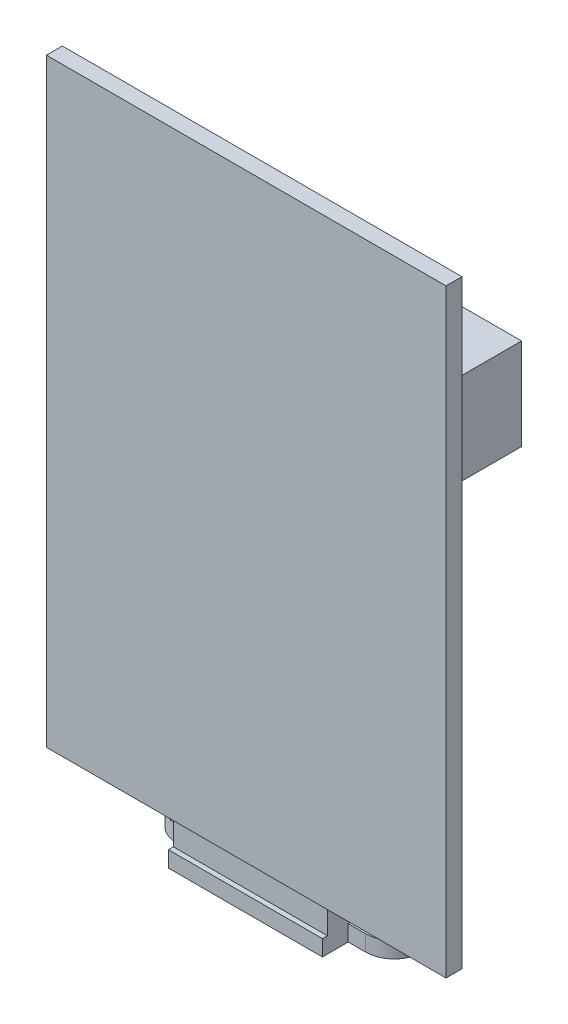
ISO-10303-21;
HEADER;
FILE_DESCRIPTION(('STEP AP214'),'2;1');
FILE_NAME('part.step','',(''),(''),'','','');
FILE_SCHEMA(('AUTOMOTIVE_DESIGN { 1 0 10303 214 1 1 1 1 }'));
ENDSEC;
DATA;
#1=APPLICATION_CONTEXT('core data for automotive mechanical design processes');
#2=APPLICATION_PROTOCOL_DEFINITION('international standard','automotive_design',2000,#1);
#3=PRODUCT_CONTEXT('',#1,'mechanical');
#4=PRODUCT('Part','Part','',(#3));
#5=PRODUCT_RELATED_PRODUCT_CATEGORY('part','',(#4));
#6=PRODUCT_DEFINITION_FORMATION('','',#4);
#7=PRODUCT_DEFINITION_CONTEXT('part definition',#1,'design');
#8=PRODUCT_DEFINITION('design','',#6,#7);
#9=PRODUCT_DEFINITION_SHAPE('','',#8);
#10=(LENGTH_UNIT() NAMED_UNIT(*) SI_UNIT(.MILLI.,.METRE.));
#11=(NAMED_UNIT(*) PLANE_ANGLE_UNIT() SI_UNIT($,.RADIAN.));
#12=(NAMED_UNIT(*) SI_UNIT($,.STERADIAN.) SOLID_ANGLE_UNIT());
#13=UNCERTAINTY_MEASURE_WITH_UNIT(LENGTH_MEASURE(1.E-05),#10,'distance_accuracy_value','');
#14=(GEOMETRIC_REPRESENTATION_CONTEXT(3) GLOBAL_UNCERTAINTY_ASSIGNED_CONTEXT((#13)) GLOBAL_UNIT_ASSIGNED_CONTEXT((#10,
#11,#12)) REPRESENTATION_CONTEXT('',''));
#15=CARTESIAN_POINT('',(0.,0.,0.));
#16=DIRECTION('',(0.,0.,1.));
#17=DIRECTION('',(1.,0.,0.));
#18=AXIS2_PLACEMENT_3D('',#15,#16,#17);
#19=CARTESIAN_POINT('',(-12.35,64.6,9.31228147882347));
#20=DIRECTION('',(0.,0.,1.));
#21=DIRECTION('',(1.,0.,0.));
#22=AXIS2_PLACEMENT_3D('',#19,#20,#21);
#23=PLANE('',#22);
#24=DIRECTION('',(-1.,0.,0.));
#25=VECTOR('',#24,1.);
#26=CARTESIAN_POINT('',(-12.35,4.3,9.31228147882347));
#27=LINE('',#26,#25);
#28=CARTESIAN_POINT('',(27.85,4.3,9.31228147882347));
#29=VERTEX_POINT('',#28);
#30=CARTESIAN_POINT('',(15.5,4.3,9.31228147882347));
#31=VERTEX_POINT('',#30);
#32=EDGE_CURVE('E48',#29,#31,#27,.T.);
#33=ORIENTED_EDGE('',*,*,#32,.T.);
#34=CARTESIAN_POINT('',(0.,4.3,9.31228147882347));
#35=VERTEX_POINT('',#34);
#36=EDGE_CURVE('E11',#31,#35,#27,.T.);
#37=ORIENTED_EDGE('',*,*,#36,.T.);
#38=CARTESIAN_POINT('',(-12.35,4.3,9.31228147882347));
#39=VERTEX_POINT('',#38);
#40=EDGE_CURVE('E49',#35,#39,#27,.T.);
#41=ORIENTED_EDGE('',*,*,#40,.T.);
#42=DIRECTION('',(0.,-1.,0.));
#43=VECTOR('',#42,1.);
#44=CARTESIAN_POINT('',(-12.35,64.6,9.31228147882347));
#45=LINE('',#44,#43);
#46=CARTESIAN_POINT('',(-12.35,64.6,9.31228147882347));
#47=VERTEX_POINT('',#46);
#48=EDGE_CURVE('E257',#47,#39,#45,.T.);
#49=ORIENTED_EDGE('',*,*,#48,.F.);
#50=DIRECTION('',(-1.,0.,0.));
#51=VECTOR('',#50,1.);
#52=CARTESIAN_POINT('',(-12.35,64.6,9.31228147882347));
#53=LINE('',#52,#51);
#54=CARTESIAN_POINT('',(27.85,64.6,9.31228147882347));
#55=VERTEX_POINT('',#54);
#56=EDGE_CURVE('E240',#55,#47,#53,.T.);
#57=ORIENTED_EDGE('',*,*,#56,.F.);
#58=DIRECTION('',(0.,-1.,0.));
#59=VECTOR('',#58,1.);
#60=CARTESIAN_POINT('',(27.85,64.6,9.31228147882347));
#61=LINE('',#60,#59);
#62=EDGE_CURVE('E260',#55,#29,#61,.T.);
#63=ORIENTED_EDGE('',*,*,#62,.T.);
#64=EDGE_LOOP('',(#33,#37,#41,#49,#57,#63));
#65=FACE_BOUND('',#64,.T.);
#66=DIRECTION('',(0.,-1.,0.));
#67=VECTOR('',#66,1.);
#68=CARTESIAN_POINT('',(21.75,40.7,9.31228147882347));
#69=LINE('',#68,#67);
#70=CARTESIAN_POINT('',(21.75,49.9,9.31228147882347));
#71=VERTEX_POINT('',#70);
#72=CARTESIAN_POINT('',(21.75,40.7,9.31228147882347));
#73=VERTEX_POINT('',#72);
#74=EDGE_CURVE('E228',#71,#73,#69,.T.);
#75=ORIENTED_EDGE('',*,*,#74,.F.);
#76=DIRECTION('',(1.,0.,0.));
#77=VECTOR('',#76,1.);
#78=CARTESIAN_POINT('',(21.75,49.9,9.31228147882347));
#79=LINE('',#78,#77);
#80=CARTESIAN_POINT('',(-8.35,49.9,9.31228147882347));
#81=VERTEX_POINT('',#80);
#82=EDGE_CURVE('E225',#81,#71,#79,.T.);
#83=ORIENTED_EDGE('',*,*,#82,.F.);
#84=DIRECTION('',(0.,1.,0.));
#85=VECTOR('',#84,1.);
#86=CARTESIAN_POINT('',(-8.35,40.7,9.31228147882347));
#87=LINE('',#86,#85);
#88=CARTESIAN_POINT('',(-8.35,40.7,9.31228147882347));
#89=VERTEX_POINT('',#88);
#90=EDGE_CURVE('E61',#89,#81,#87,.T.);
#91=ORIENTED_EDGE('',*,*,#90,.F.);
#92=DIRECTION('',(-1.,0.,0.));
#93=VECTOR('',#92,1.);
#94=CARTESIAN_POINT('',(21.75,40.7,9.31228147882347));
#95=LINE('',#94,#93);
#96=EDGE_CURVE('E56',#73,#89,#95,.T.);
#97=ORIENTED_EDGE('',*,*,#96,.F.);
#98=EDGE_LOOP('',(#75,#83,#91,#97));
#99=FACE_BOUND('',#98,.T.);
#100=ADVANCED_FACE('F37',(#65,#99),#23,.F.);
#101=CARTESIAN_POINT('',(0.,4.3,0.));
#102=DIRECTION('',(0.,-1.,0.));
#103=DIRECTION('',(0.,0.,-1.));
#104=AXIS2_PLACEMENT_3D('',#101,#102,#103);
#105=PLANE('',#104);
#106=ORIENTED_EDGE('',*,*,#36,.F.);
#107=DIRECTION('',(0.,0.,-1.));
#108=VECTOR('',#107,1.);
#109=CARTESIAN_POINT('',(15.5,4.3,10.5));
#110=LINE('',#109,#108);
#111=CARTESIAN_POINT('',(15.5,4.3,7.80000000000001));
#112=VERTEX_POINT('',#111);
#113=EDGE_CURVE('E268',#31,#112,#110,.T.);
#114=ORIENTED_EDGE('',*,*,#113,.T.);
#115=DIRECTION('',(-1.,0.,0.));
#116=VECTOR('',#115,1.);
#117=CARTESIAN_POINT('',(0.,4.3,7.80000000000001));
#118=LINE('',#117,#116);
#119=CARTESIAN_POINT('',(0.,4.3,7.80000000000001));
#120=VERTEX_POINT('',#119);
#121=EDGE_CURVE('E267',#112,#120,#118,.T.);
#122=ORIENTED_EDGE('',*,*,#121,.T.);
#123=DIRECTION('',(0.,0.,1.));
#124=VECTOR('',#123,1.);
#125=CARTESIAN_POINT('',(0.,4.3,10.5));
#126=LINE('',#125,#124);
#127=EDGE_CURVE('E271',#120,#35,#126,.T.);
#128=ORIENTED_EDGE('',*,*,#127,.T.);
#129=EDGE_LOOP('',(#106,#114,#122,#128));
#130=FACE_BOUND('',#129,.T.);
#131=ADVANCED_FACE('F431',(#130),#105,.F.);
#132=CARTESIAN_POINT('',(0.,1.6,0.));
#133=DIRECTION('',(0.,1.,0.));
#134=DIRECTION('',(0.,0.,1.));
#135=AXIS2_PLACEMENT_3D('',#132,#133,#134);
#136=PLANE('',#135);
#137=DIRECTION('',(1.,0.,0.));
#138=VECTOR('',#137,1.);
#139=CARTESIAN_POINT('',(0.,1.6,10.5));
#140=LINE('',#139,#138);
#141=CARTESIAN_POINT('',(0.,1.6,10.5));
#142=VERTEX_POINT('',#141);
#143=CARTESIAN_POINT('',(15.5,1.6,10.5));
#144=VERTEX_POINT('',#143);
#145=EDGE_CURVE('E284',#142,#144,#140,.T.);
#146=ORIENTED_EDGE('',*,*,#145,.F.);
#147=DIRECTION('',(0.,0.,1.));
#148=VECTOR('',#147,1.);
#149=CARTESIAN_POINT('',(0.,1.6,0.));
#150=LINE('',#149,#148);
#151=CARTESIAN_POINT('',(0.,1.6,11.));
#152=VERTEX_POINT('',#151);
#153=EDGE_CURVE('E366',#142,#152,#150,.T.);
#154=ORIENTED_EDGE('',*,*,#153,.T.);
#155=DIRECTION('',(1.,0.,0.));
#156=VECTOR('',#155,1.);
#157=CARTESIAN_POINT('',(0.,1.6,11.));
#158=LINE('',#157,#156);
#159=CARTESIAN_POINT('',(15.5,1.6,11.));
#160=VERTEX_POINT('',#159);
#161=EDGE_CURVE('E365',#152,#160,#158,.T.);
#162=ORIENTED_EDGE('',*,*,#161,.T.);
#163=DIRECTION('',(0.,0.,-1.));
#164=VECTOR('',#163,1.);
#165=CARTESIAN_POINT('',(15.5,1.6,0.));
#166=LINE('',#165,#164);
#167=EDGE_CURVE('E369',#160,#144,#166,.T.);
#168=ORIENTED_EDGE('',*,*,#167,.T.);
#169=EDGE_LOOP('',(#146,#154,#162,#168));
#170=FACE_BOUND('',#169,.T.);
#171=ADVANCED_FACE('F471',(#170),#136,.T.);
#172=CARTESIAN_POINT('',(15.5,1.6,0.));
#173=DIRECTION('',(-1.,0.,0.));
#174=DIRECTION('',(0.,0.,1.));
#175=AXIS2_PLACEMENT_3D('',#172,#173,#174);
#176=PLANE('',#175);
#177=DIRECTION('',(0.,1.,0.));
#178=VECTOR('',#177,1.);
#179=CARTESIAN_POINT('',(15.5,0.,2.6));
#180=LINE('',#179,#178);
#181=CARTESIAN_POINT('',(15.5,0.,2.6));
#182=VERTEX_POINT('',#181);
#183=CARTESIAN_POINT('',(15.5,1.6,2.6));
#184=VERTEX_POINT('',#183);
#185=EDGE_CURVE('E322',#182,#184,#180,.T.);
#186=ORIENTED_EDGE('',*,*,#185,.F.);
#187=DIRECTION('',(0.,0.,-1.));
#188=VECTOR('',#187,1.);
#189=CARTESIAN_POINT('',(15.5,0.,0.));
#190=LINE('',#189,#188);
#191=CARTESIAN_POINT('',(15.5,0.,0.));
#192=VERTEX_POINT('',#191);
#193=EDGE_CURVE('E379',#182,#192,#190,.T.);
#194=ORIENTED_EDGE('',*,*,#193,.T.);
#195=DIRECTION('',(0.,-1.,0.));
#196=VECTOR('',#195,1.);
#197=CARTESIAN_POINT('',(15.5,1.6,0.));
#198=LINE('',#197,#196);
#199=CARTESIAN_POINT('',(15.5,1.6,0.));
#200=VERTEX_POINT('',#199);
#201=EDGE_CURVE('E387',#200,#192,#198,.T.);
#202=ORIENTED_EDGE('',*,*,#201,.F.);
#203=EDGE_CURVE('E368',#184,#200,#166,.T.);
#204=ORIENTED_EDGE('',*,*,#203,.F.);
#205=EDGE_LOOP('',(#186,#194,#202,#204));
#206=FACE_BOUND('',#205,.T.);
#207=ADVANCED_FACE('F522',(#206),#176,.F.);
#208=CARTESIAN_POINT('',(0.,1.6,0.));
#209=DIRECTION('',(1.,0.,0.));
#210=DIRECTION('',(0.,0.,-1.));
#211=AXIS2_PLACEMENT_3D('',#208,#209,#210);
#212=PLANE('',#211);
#213=DIRECTION('',(0.,1.,0.));
#214=VECTOR('',#213,1.);
#215=CARTESIAN_POINT('',(0.,0.,8.4));
#216=LINE('',#215,#214);
#217=CARTESIAN_POINT('',(0.,0.,8.4));
#218=VERTEX_POINT('',#217);
#219=CARTESIAN_POINT('',(0.,1.6,8.4));
#220=VERTEX_POINT('',#219);
#221=EDGE_CURVE('E353',#218,#220,#216,.T.);
#222=ORIENTED_EDGE('',*,*,#221,.F.);
#223=DIRECTION('',(0.,0.,1.));
#224=VECTOR('',#223,1.);
#225=CARTESIAN_POINT('',(0.,0.,0.));
#226=LINE('',#225,#224);
#227=CARTESIAN_POINT('',(0.,0.,11.));
#228=VERTEX_POINT('',#227);
#229=EDGE_CURVE('E355',#218,#228,#226,.T.);
#230=ORIENTED_EDGE('',*,*,#229,.T.);
#231=DIRECTION('',(0.,-1.,0.));
#232=VECTOR('',#231,1.);
#233=CARTESIAN_POINT('',(0.,1.6,11.));
#234=LINE('',#233,#232);
#235=EDGE_CURVE('E41',#152,#228,#234,.T.);
#236=ORIENTED_EDGE('',*,*,#235,.F.);
#237=ORIENTED_EDGE('',*,*,#153,.F.);
#238=DIRECTION('',(0.,-1.,0.));
#239=VECTOR('',#238,1.);
#240=CARTESIAN_POINT('',(0.,4.3,10.5));
#241=LINE('',#240,#239);
#242=CARTESIAN_POINT('',(0.,4.3,10.5));
#243=VERTEX_POINT('',#242);
#244=EDGE_CURVE('E289',#243,#142,#241,.T.);
#245=ORIENTED_EDGE('',*,*,#244,.F.);
#246=EDGE_CURVE('E270',#35,#243,#126,.T.);
#247=ORIENTED_EDGE('',*,*,#246,.F.);
#248=ORIENTED_EDGE('',*,*,#127,.F.);
#249=DIRECTION('',(0.,-1.,0.));
#250=VECTOR('',#249,1.);
#251=CARTESIAN_POINT('',(0.,4.3,7.80000000000001));
#252=LINE('',#251,#250);
#253=CARTESIAN_POINT('',(0.,1.6,7.80000000000001));
#254=VERTEX_POINT('',#253);
#255=EDGE_CURVE('E292',#120,#254,#252,.T.);
#256=ORIENTED_EDGE('',*,*,#255,.T.);
#257=DIRECTION('',(0.,0.,1.));
#258=VECTOR('',#257,1.);
#259=CARTESIAN_POINT('',(0.,1.6,10.5));
#260=LINE('',#259,#258);
#261=EDGE_CURVE('E281',#254,#220,#260,.T.);
#262=ORIENTED_EDGE('',*,*,#261,.T.);
#263=EDGE_LOOP('',(#222,#230,#236,#237,#245,#247,#248,#256,#262));
#264=FACE_BOUND('',#263,.T.);
#265=ADVANCED_FACE('F404',(#264),#212,.F.);
#266=CARTESIAN_POINT('',(0.,0.,0.));
#267=VERTEX_POINT('',#266);
#268=CARTESIAN_POINT('',(0.,0.,2.6));
#269=VERTEX_POINT('',#268);
#270=EDGE_CURVE('E374',#267,#269,#226,.T.);
#271=ORIENTED_EDGE('',*,*,#270,.T.);
#272=DIRECTION('',(0.,1.,0.));
#273=VECTOR('',#272,1.);
#274=CARTESIAN_POINT('',(0.,0.,2.6));
#275=LINE('',#274,#273);
#276=CARTESIAN_POINT('',(0.,1.6,2.6));
#277=VERTEX_POINT('',#276);
#278=EDGE_CURVE('E343',#269,#277,#275,.T.);
#279=ORIENTED_EDGE('',*,*,#278,.T.);
#280=CARTESIAN_POINT('',(0.,1.6,0.));
#281=VERTEX_POINT('',#280);
#282=EDGE_CURVE('E362',#281,#277,#150,.T.);
#283=ORIENTED_EDGE('',*,*,#282,.F.);
#284=DIRECTION('',(0.,-1.,0.));
#285=VECTOR('',#284,1.);
#286=CARTESIAN_POINT('',(0.,1.6,0.));
#287=LINE('',#286,#285);
#288=EDGE_CURVE('E373',#281,#267,#287,.T.);
#289=ORIENTED_EDGE('',*,*,#288,.T.);
#290=EDGE_LOOP('',(#271,#279,#283,#289));
#291=FACE_BOUND('',#290,.T.);
#292=ADVANCED_FACE('F39',(#291),#212,.F.);
#293=CARTESIAN_POINT('',(0.,1.6,11.));
#294=DIRECTION('',(0.,0.,-1.));
#295=DIRECTION('',(-1.,0.,0.));
#296=AXIS2_PLACEMENT_3D('',#293,#294,#295);
#297=PLANE('',#296);
#298=DIRECTION('',(1.,0.,0.));
#299=VECTOR('',#298,1.);
#300=CARTESIAN_POINT('',(0.,0.,11.));
#301=LINE('',#300,#299);
#302=CARTESIAN_POINT('',(15.5,0.,11.));
#303=VERTEX_POINT('',#302);
#304=EDGE_CURVE('E377',#228,#303,#301,.T.);
#305=ORIENTED_EDGE('',*,*,#304,.T.);
#306=DIRECTION('',(0.,-1.,0.));
#307=VECTOR('',#306,1.);
#308=CARTESIAN_POINT('',(15.5,1.6,11.));
#309=LINE('',#308,#307);
#310=EDGE_CURVE('E389',#160,#303,#309,.T.);
#311=ORIENTED_EDGE('',*,*,#310,.F.);
#312=ORIENTED_EDGE('',*,*,#161,.F.);
#313=ORIENTED_EDGE('',*,*,#235,.T.);
#314=EDGE_LOOP('',(#305,#311,#312,#313));
#315=FACE_BOUND('',#314,.T.);
#316=ADVANCED_FACE('F399',(#315),#297,.F.);
#317=CARTESIAN_POINT('',(15.5,0.,8.4));
#318=VERTEX_POINT('',#317);
#319=EDGE_CURVE('E380',#303,#318,#190,.T.);
#320=ORIENTED_EDGE('',*,*,#319,.T.);
#321=DIRECTION('',(0.,1.,0.));
#322=VECTOR('',#321,1.);
#323=CARTESIAN_POINT('',(15.5,0.,8.4));
#324=LINE('',#323,#322);
#325=CARTESIAN_POINT('',(15.5,1.6,8.4));
#326=VERTEX_POINT('',#325);
#327=EDGE_CURVE('E311',#318,#326,#324,.T.);
#328=ORIENTED_EDGE('',*,*,#327,.T.);
#329=DIRECTION('',(0.,0.,-1.));
#330=VECTOR('',#329,1.);
#331=CARTESIAN_POINT('',(15.5,1.6,10.5));
#332=LINE('',#331,#330);
#333=CARTESIAN_POINT('',(15.5,1.6,7.80000000000001));
#334=VERTEX_POINT('',#333);
#335=EDGE_CURVE('E46',#326,#334,#332,.T.);
#336=ORIENTED_EDGE('',*,*,#335,.T.);
#337=DIRECTION('',(0.,-1.,0.));
#338=VECTOR('',#337,1.);
#339=CARTESIAN_POINT('',(15.5,4.3,7.80000000000001));
#340=LINE('',#339,#338);
#341=EDGE_CURVE('E295',#112,#334,#340,.T.);
#342=ORIENTED_EDGE('',*,*,#341,.F.);
#343=ORIENTED_EDGE('',*,*,#113,.F.);
#344=CARTESIAN_POINT('',(15.5,4.3,10.5));
#345=VERTEX_POINT('',#344);
#346=EDGE_CURVE('E264',#345,#31,#110,.T.);
#347=ORIENTED_EDGE('',*,*,#346,.F.);
#348=DIRECTION('',(0.,-1.,0.));
#349=VECTOR('',#348,1.);
#350=CARTESIAN_POINT('',(15.5,4.3,10.5));
#351=LINE('',#350,#349);
#352=EDGE_CURVE('E276',#345,#144,#351,.T.);
#353=ORIENTED_EDGE('',*,*,#352,.T.);
#354=ORIENTED_EDGE('',*,*,#167,.F.);
#355=ORIENTED_EDGE('',*,*,#310,.T.);
#356=EDGE_LOOP('',(#320,#328,#336,#342,#343,#347,#353,#354,#355));
#357=FACE_BOUND('',#356,.T.);
#358=ADVANCED_FACE('F413',(#357),#176,.F.);
#359=CARTESIAN_POINT('',(0.,1.6,0.));
#360=DIRECTION('',(0.,0.,1.));
#361=DIRECTION('',(1.,0.,0.));
#362=AXIS2_PLACEMENT_3D('',#359,#360,#361);
#363=PLANE('',#362);
#364=DIRECTION('',(-1.,0.,0.));
#365=VECTOR('',#364,1.);
#366=CARTESIAN_POINT('',(0.,0.,0.));
#367=LINE('',#366,#365);
#368=EDGE_CURVE('E383',#192,#267,#367,.T.);
#369=ORIENTED_EDGE('',*,*,#368,.T.);
#370=ORIENTED_EDGE('',*,*,#288,.F.);
#371=DIRECTION('',(-1.,0.,0.));
#372=VECTOR('',#371,1.);
#373=CARTESIAN_POINT('',(0.,1.6,0.));
#374=LINE('',#373,#372);
#375=EDGE_CURVE('E371',#200,#281,#374,.T.);
#376=ORIENTED_EDGE('',*,*,#375,.F.);
#377=ORIENTED_EDGE('',*,*,#201,.T.);
#378=EDGE_LOOP('',(#369,#370,#376,#377));
#379=FACE_BOUND('',#378,.T.);
#380=ADVANCED_FACE('F515',(#379),#363,.F.);
#381=ORIENTED_EDGE('',*,*,#335,.F.);
#382=DIRECTION('',(1.,0.,0.));
#383=VECTOR('',#382,1.);
#384=CARTESIAN_POINT('',(0.,1.6,8.4));
#385=LINE('',#384,#383);
#386=CARTESIAN_POINT('',(17.25,1.6,8.4));
#387=VERTEX_POINT('',#386);
#388=EDGE_CURVE('E298',#326,#387,#385,.T.);
#389=ORIENTED_EDGE('',*,*,#388,.T.);
#390=CARTESIAN_POINT('',(17.25,1.6,5.50000000000001));
#391=DIRECTION('',(0.,1.,0.));
#392=DIRECTION('',(0.,0.,1.));
#393=AXIS2_PLACEMENT_3D('',#390,#391,#392);
#394=CIRCLE('',#393,2.9);
#395=CARTESIAN_POINT('',(17.25,1.6,2.6));
#396=VERTEX_POINT('',#395);
#397=EDGE_CURVE('E314',#387,#396,#394,.T.);
#398=ORIENTED_EDGE('',*,*,#397,.T.);
#399=DIRECTION('',(1.,0.,0.));
#400=VECTOR('',#399,1.);
#401=CARTESIAN_POINT('',(0.,1.6,2.6));
#402=LINE('',#401,#400);
#403=EDGE_CURVE('E317',#184,#396,#402,.T.);
#404=ORIENTED_EDGE('',*,*,#403,.F.);
#405=ORIENTED_EDGE('',*,*,#203,.T.);
#406=ORIENTED_EDGE('',*,*,#375,.T.);
#407=ORIENTED_EDGE('',*,*,#282,.T.);
#408=DIRECTION('',(1.,0.,0.));
#409=VECTOR('',#408,1.);
#410=CARTESIAN_POINT('',(0.,1.6,2.6));
#411=LINE('',#410,#409);
#412=CARTESIAN_POINT('',(-1.74999999999999,1.6,2.6));
#413=VERTEX_POINT('',#412);
#414=EDGE_CURVE('E346',#413,#277,#411,.T.);
#415=ORIENTED_EDGE('',*,*,#414,.F.);
#416=CARTESIAN_POINT('',(-1.74999999999999,1.6,5.50000000000001));
#417=DIRECTION('',(0.,1.,0.));
#418=DIRECTION('',(0.,0.,1.));
#419=AXIS2_PLACEMENT_3D('',#416,#417,#418);
#420=CIRCLE('',#419,2.9);
#421=CARTESIAN_POINT('',(-1.74999999999999,1.6,8.4));
#422=VERTEX_POINT('',#421);
#423=EDGE_CURVE('E348',#413,#422,#420,.T.);
#424=ORIENTED_EDGE('',*,*,#423,.T.);
#425=DIRECTION('',(1.,0.,0.));
#426=VECTOR('',#425,1.);
#427=CARTESIAN_POINT('',(0.,1.6,8.4));
#428=LINE('',#427,#426);
#429=EDGE_CURVE('E336',#422,#220,#428,.T.);
#430=ORIENTED_EDGE('',*,*,#429,.T.);
#431=ORIENTED_EDGE('',*,*,#261,.F.);
#432=DIRECTION('',(-1.,0.,0.));
#433=VECTOR('',#432,1.);
#434=CARTESIAN_POINT('',(0.,1.6,7.80000000000001));
#435=LINE('',#434,#433);
#436=EDGE_CURVE('E263',#334,#254,#435,.T.);
#437=ORIENTED_EDGE('',*,*,#436,.F.);
#438=EDGE_LOOP('',(#381,#389,#398,#404,#405,#406,#407,#415,#424,#430,#431,#437));
#439=FACE_BOUND('',#438,.T.);
#440=CARTESIAN_POINT('',(-1.74999999999999,1.6,5.50000000000001));
#441=DIRECTION('',(0.,1.,0.));
#442=DIRECTION('',(0.,0.,1.));
#443=AXIS2_PLACEMENT_3D('',#440,#441,#442);
#444=CIRCLE('',#443,1.5);
#445=CARTESIAN_POINT('',(-1.74999999999999,1.6,7.00000000000001));
#446=VERTEX_POINT('',#445);
#447=EDGE_CURVE('E325',#446,#446,#444,.T.);
#448=ORIENTED_EDGE('',*,*,#447,.F.);
#449=EDGE_LOOP('',(#448));
#450=FACE_BOUND('',#449,.T.);
#451=CARTESIAN_POINT('',(17.25,1.6,5.50000000000001));
#452=DIRECTION('',(0.,1.,0.));
#453=DIRECTION('',(0.,0.,1.));
#454=AXIS2_PLACEMENT_3D('',#451,#452,#453);
#455=CIRCLE('',#454,1.5);
#456=CARTESIAN_POINT('',(17.25,1.6,7.00000000000001));
#457=VERTEX_POINT('',#456);
#458=EDGE_CURVE('E303',#457,#457,#455,.T.);
#459=ORIENTED_EDGE('',*,*,#458,.F.);
#460=EDGE_LOOP('',(#459));
#461=FACE_BOUND('',#460,.T.);
#462=ADVANCED_FACE('F420',(#439,#450,#461),#136,.T.);
#463=CARTESIAN_POINT('',(0.,0.,0.));
#464=DIRECTION('',(0.,1.,0.));
#465=DIRECTION('',(0.,0.,1.));
#466=AXIS2_PLACEMENT_3D('',#463,#464,#465);
#467=PLANE('',#466);
#468=ORIENTED_EDGE('',*,*,#270,.F.);
#469=ORIENTED_EDGE('',*,*,#368,.F.);
#470=ORIENTED_EDGE('',*,*,#193,.F.);
#471=DIRECTION('',(1.,0.,0.));
#472=VECTOR('',#471,1.);
#473=CARTESIAN_POINT('',(0.,0.,2.6));
#474=LINE('',#473,#472);
#475=CARTESIAN_POINT('',(17.25,0.,2.6));
#476=VERTEX_POINT('',#475);
#477=EDGE_CURVE('E306',#182,#476,#474,.T.);
#478=ORIENTED_EDGE('',*,*,#477,.T.);
#479=CARTESIAN_POINT('',(17.25,0.,5.50000000000001));
#480=DIRECTION('',(0.,1.,0.));
#481=DIRECTION('',(0.,0.,1.));
#482=AXIS2_PLACEMENT_3D('',#479,#480,#481);
#483=CIRCLE('',#482,2.9);
#484=CARTESIAN_POINT('',(17.25,0.,8.4));
#485=VERTEX_POINT('',#484);
#486=EDGE_CURVE('E302',#485,#476,#483,.T.);
#487=ORIENTED_EDGE('',*,*,#486,.F.);
#488=DIRECTION('',(1.,0.,0.));
#489=VECTOR('',#488,1.);
#490=CARTESIAN_POINT('',(0.,0.,8.4));
#491=LINE('',#490,#489);
#492=EDGE_CURVE('E299',#318,#485,#491,.T.);
#493=ORIENTED_EDGE('',*,*,#492,.F.);
#494=ORIENTED_EDGE('',*,*,#319,.F.);
#495=ORIENTED_EDGE('',*,*,#304,.F.);
#496=ORIENTED_EDGE('',*,*,#229,.F.);
#497=DIRECTION('',(1.,0.,0.));
#498=VECTOR('',#497,1.);
#499=CARTESIAN_POINT('',(0.,0.,8.4));
#500=LINE('',#499,#498);
#501=CARTESIAN_POINT('',(-1.74999999999999,0.,8.4));
#502=VERTEX_POINT('',#501);
#503=EDGE_CURVE('E341',#502,#218,#500,.T.);
#504=ORIENTED_EDGE('',*,*,#503,.F.);
#505=CARTESIAN_POINT('',(-1.74999999999999,0.,5.50000000000001));
#506=DIRECTION('',(0.,1.,0.));
#507=DIRECTION('',(0.,0.,1.));
#508=AXIS2_PLACEMENT_3D('',#505,#506,#507);
#509=CIRCLE('',#508,2.9);
#510=CARTESIAN_POINT('',(-1.74999999999999,0.,2.6));
#511=VERTEX_POINT('',#510);
#512=EDGE_CURVE('E338',#511,#502,#509,.T.);
#513=ORIENTED_EDGE('',*,*,#512,.F.);
#514=DIRECTION('',(1.,0.,0.));
#515=VECTOR('',#514,1.);
#516=CARTESIAN_POINT('',(0.,0.,2.6));
#517=LINE('',#516,#515);
#518=EDGE_CURVE('E335',#511,#269,#517,.T.);
#519=ORIENTED_EDGE('',*,*,#518,.T.);
#520=EDGE_LOOP('',(#468,#469,#470,#478,#487,#493,#494,#495,#496,#504,#513,#519));
#521=FACE_BOUND('',#520,.T.);
#522=CARTESIAN_POINT('',(-1.74999999999999,0.,5.50000000000001));
#523=DIRECTION('',(0.,1.,0.));
#524=DIRECTION('',(0.,0.,1.));
#525=AXIS2_PLACEMENT_3D('',#522,#523,#524);
#526=CIRCLE('',#525,1.5);
#527=CARTESIAN_POINT('',(-1.74999999999999,0.,7.00000000000001));
#528=VERTEX_POINT('',#527);
#529=EDGE_CURVE('E332',#528,#528,#526,.T.);
#530=ORIENTED_EDGE('',*,*,#529,.T.);
#531=EDGE_LOOP('',(#530));
#532=FACE_BOUND('',#531,.T.);
#533=CARTESIAN_POINT('',(17.25,0.,5.50000000000001));
#534=DIRECTION('',(0.,1.,0.));
#535=DIRECTION('',(0.,0.,1.));
#536=AXIS2_PLACEMENT_3D('',#533,#534,#535);
#537=CIRCLE('',#536,1.5);
#538=CARTESIAN_POINT('',(17.25,0.,7.00000000000001));
#539=VERTEX_POINT('',#538);
#540=EDGE_CURVE('E308',#539,#539,#537,.T.);
#541=ORIENTED_EDGE('',*,*,#540,.T.);
#542=EDGE_LOOP('',(#541));
#543=FACE_BOUND('',#542,.T.);
#544=ADVANCED_FACE('F409',(#521,#532,#543),#467,.F.);
#545=CARTESIAN_POINT('',(0.,0.,8.4));
#546=DIRECTION('',(0.,0.,1.));
#547=DIRECTION('',(1.,0.,0.));
#548=AXIS2_PLACEMENT_3D('',#545,#546,#547);
#549=PLANE('',#548);
#550=ORIENTED_EDGE('',*,*,#429,.F.);
#551=DIRECTION('',(0.,1.,0.));
#552=VECTOR('',#551,1.);
#553=CARTESIAN_POINT('',(-1.74999999999999,0.,8.4));
#554=LINE('',#553,#552);
#555=EDGE_CURVE('E356',#502,#422,#554,.T.);
#556=ORIENTED_EDGE('',*,*,#555,.F.);
#557=ORIENTED_EDGE('',*,*,#503,.T.);
#558=ORIENTED_EDGE('',*,*,#221,.T.);
#559=EDGE_LOOP('',(#550,#556,#557,#558));
#560=FACE_BOUND('',#559,.T.);
#561=ADVANCED_FACE('F498',(#560),#549,.T.);
#562=CARTESIAN_POINT('',(-1.74999999999999,0.,5.50000000000001));
#563=DIRECTION('',(0.,1.,0.));
#564=DIRECTION('',(0.,0.,1.));
#565=AXIS2_PLACEMENT_3D('',#562,#563,#564);
#566=CYLINDRICAL_SURFACE('',#565,2.9);
#567=ORIENTED_EDGE('',*,*,#423,.F.);
#568=DIRECTION('',(0.,1.,0.));
#569=VECTOR('',#568,1.);
#570=CARTESIAN_POINT('',(-1.74999999999999,0.,2.6));
#571=LINE('',#570,#569);
#572=EDGE_CURVE('E358',#511,#413,#571,.T.);
#573=ORIENTED_EDGE('',*,*,#572,.F.);
#574=ORIENTED_EDGE('',*,*,#512,.T.);
#575=ORIENTED_EDGE('',*,*,#555,.T.);
#576=EDGE_LOOP('',(#567,#573,#574,#575));
#577=FACE_BOUND('',#576,.T.);
#578=ADVANCED_FACE('F501',(#577),#566,.T.);
#579=CARTESIAN_POINT('',(-1.74999999999999,0.,5.50000000000001));
#580=DIRECTION('',(0.,1.,0.));
#581=DIRECTION('',(0.,0.,1.));
#582=AXIS2_PLACEMENT_3D('',#579,#580,#581);
#583=CYLINDRICAL_SURFACE('',#582,1.5);
#584=ORIENTED_EDGE('',*,*,#529,.F.);
#585=EDGE_LOOP('',(#584));
#586=FACE_BOUND('',#585,.T.);
#587=ORIENTED_EDGE('',*,*,#447,.T.);
#588=EDGE_LOOP('',(#587));
#589=FACE_BOUND('',#588,.T.);
#590=ADVANCED_FACE('F505',(#586,#589),#583,.F.);
#591=CARTESIAN_POINT('',(0.,0.,2.6));
#592=DIRECTION('',(0.,0.,1.));
#593=DIRECTION('',(1.,0.,0.));
#594=AXIS2_PLACEMENT_3D('',#591,#592,#593);
#595=PLANE('',#594);
#596=ORIENTED_EDGE('',*,*,#414,.T.);
#597=ORIENTED_EDGE('',*,*,#278,.F.);
#598=ORIENTED_EDGE('',*,*,#518,.F.);
#599=ORIENTED_EDGE('',*,*,#572,.T.);
#600=EDGE_LOOP('',(#596,#597,#598,#599));
#601=FACE_BOUND('',#600,.T.);
#602=ADVANCED_FACE('F491',(#601),#595,.F.);
#603=CARTESIAN_POINT('',(0.,0.,2.6));
#604=DIRECTION('',(0.,0.,1.));
#605=DIRECTION('',(1.,0.,0.));
#606=AXIS2_PLACEMENT_3D('',#603,#604,#605);
#607=PLANE('',#606);
#608=ORIENTED_EDGE('',*,*,#403,.T.);
#609=DIRECTION('',(0.,1.,0.));
#610=VECTOR('',#609,1.);
#611=CARTESIAN_POINT('',(17.25,0.,2.6));
#612=LINE('',#611,#610);
#613=EDGE_CURVE('E326',#476,#396,#612,.T.);
#614=ORIENTED_EDGE('',*,*,#613,.F.);
#615=ORIENTED_EDGE('',*,*,#477,.F.);
#616=ORIENTED_EDGE('',*,*,#185,.T.);
#617=EDGE_LOOP('',(#608,#614,#615,#616));
#618=FACE_BOUND('',#617,.T.);
#619=ADVANCED_FACE('F487',(#618),#607,.F.);
#620=CARTESIAN_POINT('',(17.25,0.,5.50000000000001));
#621=DIRECTION('',(0.,1.,0.));
#622=DIRECTION('',(0.,0.,1.));
#623=AXIS2_PLACEMENT_3D('',#620,#621,#622);
#624=CYLINDRICAL_SURFACE('',#623,2.9);
#625=ORIENTED_EDGE('',*,*,#397,.F.);
#626=DIRECTION('',(0.,1.,0.));
#627=VECTOR('',#626,1.);
#628=CARTESIAN_POINT('',(17.25,0.,8.4));
#629=LINE('',#628,#627);
#630=EDGE_CURVE('E328',#485,#387,#629,.T.);
#631=ORIENTED_EDGE('',*,*,#630,.F.);
#632=ORIENTED_EDGE('',*,*,#486,.T.);
#633=ORIENTED_EDGE('',*,*,#613,.T.);
#634=EDGE_LOOP('',(#625,#631,#632,#633));
#635=FACE_BOUND('',#634,.T.);
#636=ADVANCED_FACE('F490',(#635),#624,.T.);
#637=CARTESIAN_POINT('',(0.,0.,8.4));
#638=DIRECTION('',(0.,0.,1.));
#639=DIRECTION('',(1.,0.,0.));
#640=AXIS2_PLACEMENT_3D('',#637,#638,#639);
#641=PLANE('',#640);
#642=ORIENTED_EDGE('',*,*,#388,.F.);
#643=ORIENTED_EDGE('',*,*,#327,.F.);
#644=ORIENTED_EDGE('',*,*,#492,.T.);
#645=ORIENTED_EDGE('',*,*,#630,.T.);
#646=EDGE_LOOP('',(#642,#643,#644,#645));
#647=FACE_BOUND('',#646,.T.);
#648=ADVANCED_FACE('F417',(#647),#641,.T.);
#649=CARTESIAN_POINT('',(17.25,0.,5.50000000000001));
#650=DIRECTION('',(0.,1.,0.));
#651=DIRECTION('',(0.,0.,1.));
#652=AXIS2_PLACEMENT_3D('',#649,#650,#651);
#653=CYLINDRICAL_SURFACE('',#652,1.5);
#654=ORIENTED_EDGE('',*,*,#540,.F.);
#655=EDGE_LOOP('',(#654));
#656=FACE_BOUND('',#655,.T.);
#657=ORIENTED_EDGE('',*,*,#458,.T.);
#658=EDGE_LOOP('',(#657));
#659=FACE_BOUND('',#658,.T.);
#660=ADVANCED_FACE('F483',(#656,#659),#653,.F.);
#661=CARTESIAN_POINT('',(0.,4.3,7.80000000000001));
#662=DIRECTION('',(0.,0.,1.));
#663=DIRECTION('',(1.,0.,0.));
#664=AXIS2_PLACEMENT_3D('',#661,#662,#663);
#665=PLANE('',#664);
#666=ORIENTED_EDGE('',*,*,#436,.T.);
#667=ORIENTED_EDGE('',*,*,#255,.F.);
#668=ORIENTED_EDGE('',*,*,#121,.F.);
#669=ORIENTED_EDGE('',*,*,#341,.T.);
#670=EDGE_LOOP('',(#666,#667,#668,#669));
#671=FACE_BOUND('',#670,.T.);
#672=ADVANCED_FACE('F424',(#671),#665,.F.);
#673=CARTESIAN_POINT('',(0.,4.3,10.5));
#674=DIRECTION('',(0.,0.,-1.));
#675=DIRECTION('',(-1.,0.,0.));
#676=AXIS2_PLACEMENT_3D('',#673,#674,#675);
#677=PLANE('',#676);
#678=ORIENTED_EDGE('',*,*,#145,.T.);
#679=ORIENTED_EDGE('',*,*,#352,.F.);
#680=DIRECTION('',(1.,0.,0.));
#681=VECTOR('',#680,1.);
#682=CARTESIAN_POINT('',(0.,4.3,10.5));
#683=LINE('',#682,#681);
#684=EDGE_CURVE('E273',#243,#345,#683,.T.);
#685=ORIENTED_EDGE('',*,*,#684,.F.);
#686=ORIENTED_EDGE('',*,*,#244,.T.);
#687=EDGE_LOOP('',(#678,#679,#685,#686));
#688=FACE_BOUND('',#687,.T.);
#689=ADVANCED_FACE('F477',(#688),#677,.F.);
#690=CARTESIAN_POINT('',(0.,4.3,0.));
#691=DIRECTION('',(0.,1.,0.));
#692=DIRECTION('',(0.,0.,1.));
#693=AXIS2_PLACEMENT_3D('',#690,#691,#692);
#694=PLANE('',#693);
#695=ORIENTED_EDGE('',*,*,#684,.T.);
#696=ORIENTED_EDGE('',*,*,#346,.T.);
#697=ORIENTED_EDGE('',*,*,#32,.F.);
#698=DIRECTION('',(0.,0.,-1.));
#699=VECTOR('',#698,1.);
#700=CARTESIAN_POINT('',(27.85,4.3,9.31228147882347));
#701=LINE('',#700,#699);
#702=CARTESIAN_POINT('',(27.85,4.3,10.9122814788235));
#703=VERTEX_POINT('',#702);
#704=EDGE_CURVE('E229',#703,#29,#701,.T.);
#705=ORIENTED_EDGE('',*,*,#704,.F.);
#706=DIRECTION('',(1.,0.,0.));
#707=VECTOR('',#706,1.);
#708=CARTESIAN_POINT('',(-12.35,4.3,10.9122814788235));
#709=LINE('',#708,#707);
#710=CARTESIAN_POINT('',(-12.35,4.3,10.9122814788235));
#711=VERTEX_POINT('',#710);
#712=EDGE_CURVE('E241',#711,#703,#709,.T.);
#713=ORIENTED_EDGE('',*,*,#712,.F.);
#714=DIRECTION('',(0.,0.,1.));
#715=VECTOR('',#714,1.);
#716=CARTESIAN_POINT('',(-12.35,4.3,9.31228147882347));
#717=LINE('',#716,#715);
#718=EDGE_CURVE('E249',#39,#711,#717,.T.);
#719=ORIENTED_EDGE('',*,*,#718,.F.);
#720=ORIENTED_EDGE('',*,*,#40,.F.);
#721=ORIENTED_EDGE('',*,*,#246,.T.);
#722=EDGE_LOOP('',(#695,#696,#697,#705,#713,#719,#720,#721));
#723=FACE_BOUND('',#722,.T.);
#724=ADVANCED_FACE('F435',(#723),#694,.F.);
#725=CARTESIAN_POINT('',(27.85,64.6,9.31228147882347));
#726=DIRECTION('',(-1.,0.,0.));
#727=DIRECTION('',(0.,0.,1.));
#728=AXIS2_PLACEMENT_3D('',#725,#726,#727);
#729=PLANE('',#728);
#730=ORIENTED_EDGE('',*,*,#704,.T.);
#731=ORIENTED_EDGE('',*,*,#62,.F.);
#732=DIRECTION('',(0.,0.,-1.));
#733=VECTOR('',#732,1.);
#734=CARTESIAN_POINT('',(27.85,64.6,9.31228147882347));
#735=LINE('',#734,#733);
#736=CARTESIAN_POINT('',(27.85,64.6,10.9122814788235));
#737=VERTEX_POINT('',#736);
#738=EDGE_CURVE('E237',#737,#55,#735,.T.);
#739=ORIENTED_EDGE('',*,*,#738,.F.);
#740=DIRECTION('',(0.,-1.,0.));
#741=VECTOR('',#740,1.);
#742=CARTESIAN_POINT('',(27.85,64.6,10.9122814788235));
#743=LINE('',#742,#741);
#744=EDGE_CURVE('E246',#737,#703,#743,.T.);
#745=ORIENTED_EDGE('',*,*,#744,.T.);
#746=EDGE_LOOP('',(#730,#731,#739,#745));
#747=FACE_BOUND('',#746,.T.);
#748=ADVANCED_FACE('F443',(#747),#729,.F.);
#749=CARTESIAN_POINT('',(-12.35,64.6,9.31228147882347));
#750=DIRECTION('',(1.,0.,0.));
#751=DIRECTION('',(0.,0.,-1.));
#752=AXIS2_PLACEMENT_3D('',#749,#750,#751);
#753=PLANE('',#752);
#754=ORIENTED_EDGE('',*,*,#718,.T.);
#755=DIRECTION('',(0.,-1.,0.));
#756=VECTOR('',#755,1.);
#757=CARTESIAN_POINT('',(-12.35,64.6,10.9122814788235));
#758=LINE('',#757,#756);
#759=CARTESIAN_POINT('',(-12.35,64.6,10.9122814788235));
#760=VERTEX_POINT('',#759);
#761=EDGE_CURVE('E254',#760,#711,#758,.T.);
#762=ORIENTED_EDGE('',*,*,#761,.F.);
#763=DIRECTION('',(0.,0.,1.));
#764=VECTOR('',#763,1.);
#765=CARTESIAN_POINT('',(-12.35,64.6,9.31228147882347));
#766=LINE('',#765,#764);
#767=EDGE_CURVE('E243',#47,#760,#766,.T.);
#768=ORIENTED_EDGE('',*,*,#767,.F.);
#769=ORIENTED_EDGE('',*,*,#48,.T.);
#770=EDGE_LOOP('',(#754,#762,#768,#769));
#771=FACE_BOUND('',#770,.T.);
#772=ADVANCED_FACE('F453',(#771),#753,.F.);
#773=CARTESIAN_POINT('',(-12.35,64.6,10.9122814788235));
#774=DIRECTION('',(0.,0.,-1.));
#775=DIRECTION('',(-1.,0.,0.));
#776=AXIS2_PLACEMENT_3D('',#773,#774,#775);
#777=PLANE('',#776);
#778=ORIENTED_EDGE('',*,*,#712,.T.);
#779=ORIENTED_EDGE('',*,*,#744,.F.);
#780=DIRECTION('',(1.,0.,0.));
#781=VECTOR('',#780,1.);
#782=CARTESIAN_POINT('',(-12.35,64.6,10.9122814788235));
#783=LINE('',#782,#781);
#784=EDGE_CURVE('E245',#760,#737,#783,.T.);
#785=ORIENTED_EDGE('',*,*,#784,.F.);
#786=ORIENTED_EDGE('',*,*,#761,.T.);
#787=EDGE_LOOP('',(#778,#779,#785,#786));
#788=FACE_BOUND('',#787,.T.);
#789=ADVANCED_FACE('F448',(#788),#777,.F.);
#790=CARTESIAN_POINT('',(0.,64.6,0.));
#791=DIRECTION('',(0.,1.,0.));
#792=DIRECTION('',(0.,0.,1.));
#793=AXIS2_PLACEMENT_3D('',#790,#791,#792);
#794=PLANE('',#793);
#795=ORIENTED_EDGE('',*,*,#738,.T.);
#796=ORIENTED_EDGE('',*,*,#56,.T.);
#797=ORIENTED_EDGE('',*,*,#767,.T.);
#798=ORIENTED_EDGE('',*,*,#784,.T.);
#799=EDGE_LOOP('',(#795,#796,#797,#798));
#800=FACE_BOUND('',#799,.T.);
#801=ADVANCED_FACE('F455',(#800),#794,.T.);
#802=CARTESIAN_POINT('',(21.75,40.7,-2.78771852117653));
#803=DIRECTION('',(-1.,0.,0.));
#804=DIRECTION('',(0.,0.,1.));
#805=AXIS2_PLACEMENT_3D('',#802,#803,#804);
#806=PLANE('',#805);
#807=ORIENTED_EDGE('',*,*,#74,.T.);
#808=DIRECTION('',(0.,0.,1.));
#809=VECTOR('',#808,1.);
#810=CARTESIAN_POINT('',(21.75,40.7,-2.78771852117653));
#811=LINE('',#810,#809);
#812=CARTESIAN_POINT('',(21.75,40.7,-2.78771852117653));
#813=VERTEX_POINT('',#812);
#814=EDGE_CURVE('E209',#813,#73,#811,.T.);
#815=ORIENTED_EDGE('',*,*,#814,.F.);
#816=DIRECTION('',(0.,-1.,0.));
#817=VECTOR('',#816,1.);
#818=CARTESIAN_POINT('',(21.75,40.7,-2.78771852117653));
#819=LINE('',#818,#817);
#820=CARTESIAN_POINT('',(21.75,49.9,-2.78771852117653));
#821=VERTEX_POINT('',#820);
#822=EDGE_CURVE('E216',#821,#813,#819,.T.);
#823=ORIENTED_EDGE('',*,*,#822,.F.);
#824=DIRECTION('',(0.,0.,1.));
#825=VECTOR('',#824,1.);
#826=CARTESIAN_POINT('',(21.75,49.9,-2.78771852117653));
#827=LINE('',#826,#825);
#828=EDGE_CURVE('E840',#821,#71,#827,.T.);
#829=ORIENTED_EDGE('',*,*,#828,.T.);
#830=EDGE_LOOP('',(#807,#815,#823,#829));
#831=FACE_BOUND('',#830,.T.);
#832=ADVANCED_FACE('F227',(#831),#806,.F.);
#833=CARTESIAN_POINT('',(21.75,40.7,-2.78771852117653));
#834=DIRECTION('',(0.,1.,0.));
#835=DIRECTION('',(0.,0.,1.));
#836=AXIS2_PLACEMENT_3D('',#833,#834,#835);
#837=PLANE('',#836);
#838=ORIENTED_EDGE('',*,*,#96,.T.);
#839=DIRECTION('',(0.,0.,1.));
#840=VECTOR('',#839,1.);
#841=CARTESIAN_POINT('',(-8.35,40.7,-2.78771852117653));
#842=LINE('',#841,#840);
#843=CARTESIAN_POINT('',(-8.35,40.7,-2.78771852117653));
#844=VERTEX_POINT('',#843);
#845=EDGE_CURVE('E212',#844,#89,#842,.T.);
#846=ORIENTED_EDGE('',*,*,#845,.F.);
#847=DIRECTION('',(-1.,0.,0.));
#848=VECTOR('',#847,1.);
#849=CARTESIAN_POINT('',(21.75,40.7,-2.78771852117653));
#850=LINE('',#849,#848);
#851=EDGE_CURVE('E205',#813,#844,#850,.T.);
#852=ORIENTED_EDGE('',*,*,#851,.F.);
#853=ORIENTED_EDGE('',*,*,#814,.T.);
#854=EDGE_LOOP('',(#838,#846,#852,#853));
#855=FACE_BOUND('',#854,.T.);
#856=ADVANCED_FACE('F207',(#855),#837,.F.);
#857=CARTESIAN_POINT('',(-8.35,40.7,-2.78771852117653));
#858=DIRECTION('',(1.,0.,0.));
#859=DIRECTION('',(0.,0.,-1.));
#860=AXIS2_PLACEMENT_3D('',#857,#858,#859);
#861=PLANE('',#860);
#862=ORIENTED_EDGE('',*,*,#90,.T.);
#863=DIRECTION('',(0.,0.,1.));
#864=VECTOR('',#863,1.);
#865=CARTESIAN_POINT('',(-8.35,49.9,-2.78771852117653));
#866=LINE('',#865,#864);
#867=CARTESIAN_POINT('',(-8.35,49.9,-2.78771852117653));
#868=VERTEX_POINT('',#867);
#869=EDGE_CURVE('E233',#868,#81,#866,.T.);
#870=ORIENTED_EDGE('',*,*,#869,.F.);
#871=DIRECTION('',(0.,1.,0.));
#872=VECTOR('',#871,1.);
#873=CARTESIAN_POINT('',(-8.35,40.7,-2.78771852117653));
#874=LINE('',#873,#872);
#875=EDGE_CURVE('E215',#844,#868,#874,.T.);
#876=ORIENTED_EDGE('',*,*,#875,.F.);
#877=ORIENTED_EDGE('',*,*,#845,.T.);
#878=EDGE_LOOP('',(#862,#870,#876,#877));
#879=FACE_BOUND('',#878,.T.);
#880=ADVANCED_FACE('F650',(#879),#861,.F.);
#881=CARTESIAN_POINT('',(21.75,49.9,-2.78771852117653));
#882=DIRECTION('',(0.,-1.,0.));
#883=DIRECTION('',(0.,0.,-1.));
#884=AXIS2_PLACEMENT_3D('',#881,#882,#883);
#885=PLANE('',#884);
#886=ORIENTED_EDGE('',*,*,#82,.T.);
#887=ORIENTED_EDGE('',*,*,#828,.F.);
#888=DIRECTION('',(1.,0.,0.));
#889=VECTOR('',#888,1.);
#890=CARTESIAN_POINT('',(21.75,49.9,-2.78771852117653));
#891=LINE('',#890,#889);
#892=EDGE_CURVE('E221',#868,#821,#891,.T.);
#893=ORIENTED_EDGE('',*,*,#892,.F.);
#894=ORIENTED_EDGE('',*,*,#869,.T.);
#895=EDGE_LOOP('',(#886,#887,#893,#894));
#896=FACE_BOUND('',#895,.T.);
#897=ADVANCED_FACE('F659',(#896),#885,.F.);
#898=CARTESIAN_POINT('',(0.,0.,-2.78771852117653));
#899=DIRECTION('',(0.,0.,1.));
#900=DIRECTION('',(1.,0.,0.));
#901=AXIS2_PLACEMENT_3D('',#898,#899,#900);
#902=PLANE('',#901);
#903=CARTESIAN_POINT('',(14.35,45.7,-2.78771852117653));
#904=DIRECTION('',(0.,0.,-1.));
#905=DIRECTION('',(-1.,0.,0.));
#906=AXIS2_PLACEMENT_3D('',#903,#904,#905);
#907=CIRCLE('',#906,2.);
#908=CARTESIAN_POINT('',(12.35,45.7,-2.78771852117653));
#909=VERTEX_POINT('',#908);
#910=EDGE_CURVE('E804',#909,#909,#907,.T.);
#911=ORIENTED_EDGE('',*,*,#910,.F.);
#912=EDGE_LOOP('',(#911));
#913=FACE_BOUND('',#912,.T.);
#914=CARTESIAN_POINT('',(9.35000000000001,45.7,-2.78771852117653));
#915=DIRECTION('',(0.,0.,-1.));
#916=DIRECTION('',(-1.,0.,0.));
#917=AXIS2_PLACEMENT_3D('',#914,#915,#916);
#918=CIRCLE('',#917,2.);
#919=CARTESIAN_POINT('',(7.35,45.7,-2.78771852117653));
#920=VERTEX_POINT('',#919);
#921=EDGE_CURVE('E815',#920,#920,#918,.T.);
#922=ORIENTED_EDGE('',*,*,#921,.F.);
#923=EDGE_LOOP('',(#922));
#924=FACE_BOUND('',#923,.T.);
#925=CARTESIAN_POINT('',(4.35000000000001,45.7,-2.78771852117653));
#926=DIRECTION('',(0.,0.,-1.));
#927=DIRECTION('',(-1.,0.,0.));
#928=AXIS2_PLACEMENT_3D('',#925,#926,#927);
#929=CIRCLE('',#928,2.);
#930=CARTESIAN_POINT('',(2.35,45.7,-2.78771852117653));
#931=VERTEX_POINT('',#930);
#932=EDGE_CURVE('E821',#931,#931,#929,.T.);
#933=ORIENTED_EDGE('',*,*,#932,.F.);
#934=EDGE_LOOP('',(#933));
#935=FACE_BOUND('',#934,.T.);
#936=CARTESIAN_POINT('',(-0.649999999999994,45.7,-2.78771852117653));
#937=DIRECTION('',(0.,0.,-1.));
#938=DIRECTION('',(-1.,0.,0.));
#939=AXIS2_PLACEMENT_3D('',#936,#937,#938);
#940=CIRCLE('',#939,2.);
#941=CARTESIAN_POINT('',(-2.65,45.7,-2.78771852117653));
#942=VERTEX_POINT('',#941);
#943=EDGE_CURVE('E827',#942,#942,#940,.T.);
#944=ORIENTED_EDGE('',*,*,#943,.F.);
#945=EDGE_LOOP('',(#944));
#946=FACE_BOUND('',#945,.T.);
#947=CARTESIAN_POINT('',(-5.65,45.7,-2.78771852117653));
#948=DIRECTION('',(0.,0.,-1.));
#949=DIRECTION('',(-1.,0.,0.));
#950=AXIS2_PLACEMENT_3D('',#947,#948,#949);
#951=CIRCLE('',#950,2.);
#952=CARTESIAN_POINT('',(-7.65,45.7,-2.78771852117653));
#953=VERTEX_POINT('',#952);
#954=EDGE_CURVE('E833',#953,#953,#951,.T.);
#955=ORIENTED_EDGE('',*,*,#954,.F.);
#956=EDGE_LOOP('',(#955));
#957=FACE_BOUND('',#956,.T.);
#958=CARTESIAN_POINT('',(19.35,45.7,-2.78771852117653));
#959=DIRECTION('',(0.,0.,-1.));
#960=DIRECTION('',(-1.,0.,0.));
#961=AXIS2_PLACEMENT_3D('',#958,#959,#960);
#962=CIRCLE('',#961,2.);
#963=CARTESIAN_POINT('',(17.35,45.7,-2.78771852117653));
#964=VERTEX_POINT('',#963);
#965=EDGE_CURVE('E803',#964,#964,#962,.T.);
#966=ORIENTED_EDGE('',*,*,#965,.F.);
#967=EDGE_LOOP('',(#966));
#968=FACE_BOUND('',#967,.T.);
#969=ORIENTED_EDGE('',*,*,#822,.T.);
#970=ORIENTED_EDGE('',*,*,#851,.T.);
#971=ORIENTED_EDGE('',*,*,#875,.T.);
#972=ORIENTED_EDGE('',*,*,#892,.T.);
#973=EDGE_LOOP('',(#969,#970,#971,#972));
#974=FACE_BOUND('',#973,.T.);
#975=ADVANCED_FACE('F219',(#913,#924,#935,#946,#957,#968,#974),#902,.F.);
#976=CARTESIAN_POINT('',(19.35,45.7,-0.787718521176529));
#977=DIRECTION('',(0.,0.,-1.));
#978=DIRECTION('',(-1.,0.,0.));
#979=AXIS2_PLACEMENT_3D('',#976,#977,#978);
#980=CYLINDRICAL_SURFACE('',#979,2.);
#981=CARTESIAN_POINT('',(19.35,45.7,-0.787718521176529));
#982=DIRECTION('',(0.,0.,-1.));
#983=DIRECTION('',(-1.,0.,0.));
#984=AXIS2_PLACEMENT_3D('',#981,#982,#983);
#985=CIRCLE('',#984,2.);
#986=CARTESIAN_POINT('',(17.35,45.7,-0.787718521176529));
#987=VERTEX_POINT('',#986);
#988=EDGE_CURVE('E807',#987,#987,#985,.T.);
#989=ORIENTED_EDGE('',*,*,#988,.F.);
#990=EDGE_LOOP('',(#989));
#991=FACE_BOUND('',#990,.T.);
#992=ORIENTED_EDGE('',*,*,#965,.T.);
#993=EDGE_LOOP('',(#992));
#994=FACE_BOUND('',#993,.T.);
#995=ADVANCED_FACE('F676',(#991,#994),#980,.F.);
#996=CARTESIAN_POINT('',(19.35,45.7,-0.787718521176529));
#997=DIRECTION('',(0.,0.,-1.));
#998=DIRECTION('',(-1.,0.,0.));
#999=AXIS2_PLACEMENT_3D('',#996,#997,#998);
#1000=PLANE('',#999);
#1001=ORIENTED_EDGE('',*,*,#988,.T.);
#1002=EDGE_LOOP('',(#1001));
#1003=FACE_BOUND('',#1002,.T.);
#1004=ADVANCED_FACE('F681',(#1003),#1000,.T.);
#1005=CARTESIAN_POINT('',(-5.65,45.7,-0.787718521176529));
#1006=DIRECTION('',(0.,0.,-1.));
#1007=DIRECTION('',(-1.,0.,0.));
#1008=AXIS2_PLACEMENT_3D('',#1005,#1006,#1007);
#1009=CYLINDRICAL_SURFACE('',#1008,2.);
#1010=CARTESIAN_POINT('',(-5.65,45.7,-0.787718521176529));
#1011=DIRECTION('',(0.,0.,-1.));
#1012=DIRECTION('',(-1.,0.,0.));
#1013=AXIS2_PLACEMENT_3D('',#1010,#1011,#1012);
#1014=CIRCLE('',#1013,2.);
#1015=CARTESIAN_POINT('',(-7.65,45.7,-0.787718521176529));
#1016=VERTEX_POINT('',#1015);
#1017=EDGE_CURVE('E830',#1016,#1016,#1014,.T.);
#1018=ORIENTED_EDGE('',*,*,#1017,.F.);
#1019=EDGE_LOOP('',(#1018));
#1020=FACE_BOUND('',#1019,.T.);
#1021=ORIENTED_EDGE('',*,*,#954,.T.);
#1022=EDGE_LOOP('',(#1021));
#1023=FACE_BOUND('',#1022,.T.);
#1024=ADVANCED_FACE('F691',(#1020,#1023),#1009,.F.);
#1025=CARTESIAN_POINT('',(-5.65,45.7,-0.787718521176529));
#1026=DIRECTION('',(0.,0.,-1.));
#1027=DIRECTION('',(-1.,0.,0.));
#1028=AXIS2_PLACEMENT_3D('',#1025,#1026,#1027);
#1029=PLANE('',#1028);
#1030=ORIENTED_EDGE('',*,*,#1017,.T.);
#1031=EDGE_LOOP('',(#1030));
#1032=FACE_BOUND('',#1031,.T.);
#1033=ADVANCED_FACE('F706',(#1032),#1029,.T.);
#1034=CARTESIAN_POINT('',(-0.649999999999994,45.7,-0.787718521176529));
#1035=DIRECTION('',(0.,0.,-1.));
#1036=DIRECTION('',(-1.,0.,0.));
#1037=AXIS2_PLACEMENT_3D('',#1034,#1035,#1036);
#1038=CYLINDRICAL_SURFACE('',#1037,2.);
#1039=CARTESIAN_POINT('',(-0.649999999999994,45.7,-0.787718521176529));
#1040=DIRECTION('',(0.,0.,-1.));
#1041=DIRECTION('',(-1.,0.,0.));
#1042=AXIS2_PLACEMENT_3D('',#1039,#1040,#1041);
#1043=CIRCLE('',#1042,2.);
#1044=CARTESIAN_POINT('',(-2.65,45.7,-0.787718521176529));
#1045=VERTEX_POINT('',#1044);
#1046=EDGE_CURVE('E824',#1045,#1045,#1043,.T.);
#1047=ORIENTED_EDGE('',*,*,#1046,.F.);
#1048=EDGE_LOOP('',(#1047));
#1049=FACE_BOUND('',#1048,.T.);
#1050=ORIENTED_EDGE('',*,*,#943,.T.);
#1051=EDGE_LOOP('',(#1050));
#1052=FACE_BOUND('',#1051,.T.);
#1053=ADVANCED_FACE('F716',(#1049,#1052),#1038,.F.);
#1054=CARTESIAN_POINT('',(-0.649999999999994,45.7,-0.787718521176529));
#1055=DIRECTION('',(0.,0.,-1.));
#1056=DIRECTION('',(-1.,0.,0.));
#1057=AXIS2_PLACEMENT_3D('',#1054,#1055,#1056);
#1058=PLANE('',#1057);
#1059=ORIENTED_EDGE('',*,*,#1046,.T.);
#1060=EDGE_LOOP('',(#1059));
#1061=FACE_BOUND('',#1060,.T.);
#1062=ADVANCED_FACE('F726',(#1061),#1058,.T.);
#1063=CARTESIAN_POINT('',(4.35000000000001,45.7,-0.787718521176529));
#1064=DIRECTION('',(0.,0.,-1.));
#1065=DIRECTION('',(-1.,0.,0.));
#1066=AXIS2_PLACEMENT_3D('',#1063,#1064,#1065);
#1067=CYLINDRICAL_SURFACE('',#1066,2.);
#1068=CARTESIAN_POINT('',(4.35000000000001,45.7,-0.787718521176529));
#1069=DIRECTION('',(0.,0.,-1.));
#1070=DIRECTION('',(-1.,0.,0.));
#1071=AXIS2_PLACEMENT_3D('',#1068,#1069,#1070);
#1072=CIRCLE('',#1071,2.);
#1073=CARTESIAN_POINT('',(2.35,45.7,-0.787718521176529));
#1074=VERTEX_POINT('',#1073);
#1075=EDGE_CURVE('E818',#1074,#1074,#1072,.T.);
#1076=ORIENTED_EDGE('',*,*,#1075,.F.);
#1077=EDGE_LOOP('',(#1076));
#1078=FACE_BOUND('',#1077,.T.);
#1079=ORIENTED_EDGE('',*,*,#932,.T.);
#1080=EDGE_LOOP('',(#1079));
#1081=FACE_BOUND('',#1080,.T.);
#1082=ADVANCED_FACE('F736',(#1078,#1081),#1067,.F.);
#1083=CARTESIAN_POINT('',(4.35000000000001,45.7,-0.787718521176529));
#1084=DIRECTION('',(0.,0.,-1.));
#1085=DIRECTION('',(-1.,0.,0.));
#1086=AXIS2_PLACEMENT_3D('',#1083,#1084,#1085);
#1087=PLANE('',#1086);
#1088=ORIENTED_EDGE('',*,*,#1075,.T.);
#1089=EDGE_LOOP('',(#1088));
#1090=FACE_BOUND('',#1089,.T.);
#1091=ADVANCED_FACE('F746',(#1090),#1087,.T.);
#1092=CARTESIAN_POINT('',(9.35000000000001,45.7,-0.787718521176529));
#1093=DIRECTION('',(0.,0.,-1.));
#1094=DIRECTION('',(-1.,0.,0.));
#1095=AXIS2_PLACEMENT_3D('',#1092,#1093,#1094);
#1096=CYLINDRICAL_SURFACE('',#1095,2.);
#1097=CARTESIAN_POINT('',(9.35000000000001,45.7,-0.787718521176529));
#1098=DIRECTION('',(0.,0.,-1.));
#1099=DIRECTION('',(-1.,0.,0.));
#1100=AXIS2_PLACEMENT_3D('',#1097,#1098,#1099);
#1101=CIRCLE('',#1100,2.);
#1102=CARTESIAN_POINT('',(7.35,45.7,-0.787718521176529));
#1103=VERTEX_POINT('',#1102);
#1104=EDGE_CURVE('E810',#1103,#1103,#1101,.T.);
#1105=ORIENTED_EDGE('',*,*,#1104,.F.);
#1106=EDGE_LOOP('',(#1105));
#1107=FACE_BOUND('',#1106,.T.);
#1108=ORIENTED_EDGE('',*,*,#921,.T.);
#1109=EDGE_LOOP('',(#1108));
#1110=FACE_BOUND('',#1109,.T.);
#1111=ADVANCED_FACE('F756',(#1107,#1110),#1096,.F.);
#1112=CARTESIAN_POINT('',(9.35000000000001,45.7,-0.787718521176529));
#1113=DIRECTION('',(0.,0.,-1.));
#1114=DIRECTION('',(-1.,0.,0.));
#1115=AXIS2_PLACEMENT_3D('',#1112,#1113,#1114);
#1116=PLANE('',#1115);
#1117=ORIENTED_EDGE('',*,*,#1104,.T.);
#1118=EDGE_LOOP('',(#1117));
#1119=FACE_BOUND('',#1118,.T.);
#1120=ADVANCED_FACE('F766',(#1119),#1116,.T.);
#1121=CARTESIAN_POINT('',(14.35,45.7,-0.787718521176529));
#1122=DIRECTION('',(0.,0.,-1.));
#1123=DIRECTION('',(-1.,0.,0.));
#1124=AXIS2_PLACEMENT_3D('',#1121,#1122,#1123);
#1125=CYLINDRICAL_SURFACE('',#1124,2.);
#1126=CARTESIAN_POINT('',(14.35,45.7,-0.787718521176529));
#1127=DIRECTION('',(0.,0.,-1.));
#1128=DIRECTION('',(-1.,0.,0.));
#1129=AXIS2_PLACEMENT_3D('',#1126,#1127,#1128);
#1130=CIRCLE('',#1129,2.);
#1131=CARTESIAN_POINT('',(12.35,45.7,-0.787718521176529));
#1132=VERTEX_POINT('',#1131);
#1133=EDGE_CURVE('E802',#1132,#1132,#1130,.T.);
#1134=ORIENTED_EDGE('',*,*,#1133,.F.);
#1135=EDGE_LOOP('',(#1134));
#1136=FACE_BOUND('',#1135,.T.);
#1137=ORIENTED_EDGE('',*,*,#910,.T.);
#1138=EDGE_LOOP('',(#1137));
#1139=FACE_BOUND('',#1138,.T.);
#1140=ADVANCED_FACE('F776',(#1136,#1139),#1125,.F.);
#1141=CARTESIAN_POINT('',(14.35,45.7,-0.787718521176529));
#1142=DIRECTION('',(0.,0.,-1.));
#1143=DIRECTION('',(-1.,0.,0.));
#1144=AXIS2_PLACEMENT_3D('',#1141,#1142,#1143);
#1145=PLANE('',#1144);
#1146=ORIENTED_EDGE('',*,*,#1133,.T.);
#1147=EDGE_LOOP('',(#1146));
#1148=FACE_BOUND('',#1147,.T.);
#1149=ADVANCED_FACE('F786',(#1148),#1145,.T.);
#1150=CLOSED_SHELL('',(#100,#131,#171,#207,#265,#292,#316,#358,#380,#462,#544,#561,#578,#590,
#602,#619,#636,#648,#660,#672,#689,#724,#748,#772,#789,#801,#832,#856,#880,#897,#975,#995,#1004,
#1024,#1033,#1053,#1062,#1082,#1091,#1111,#1120,#1140,#1149));
#1151=MANIFOLD_SOLID_BREP('B2',#1150);
#1152=ADVANCED_BREP_SHAPE_REPRESENTATION('',(#18,#1151),#14);
#1153=SHAPE_DEFINITION_REPRESENTATION(#9,#1152);
ENDSEC;
END-ISO-10303-21;
